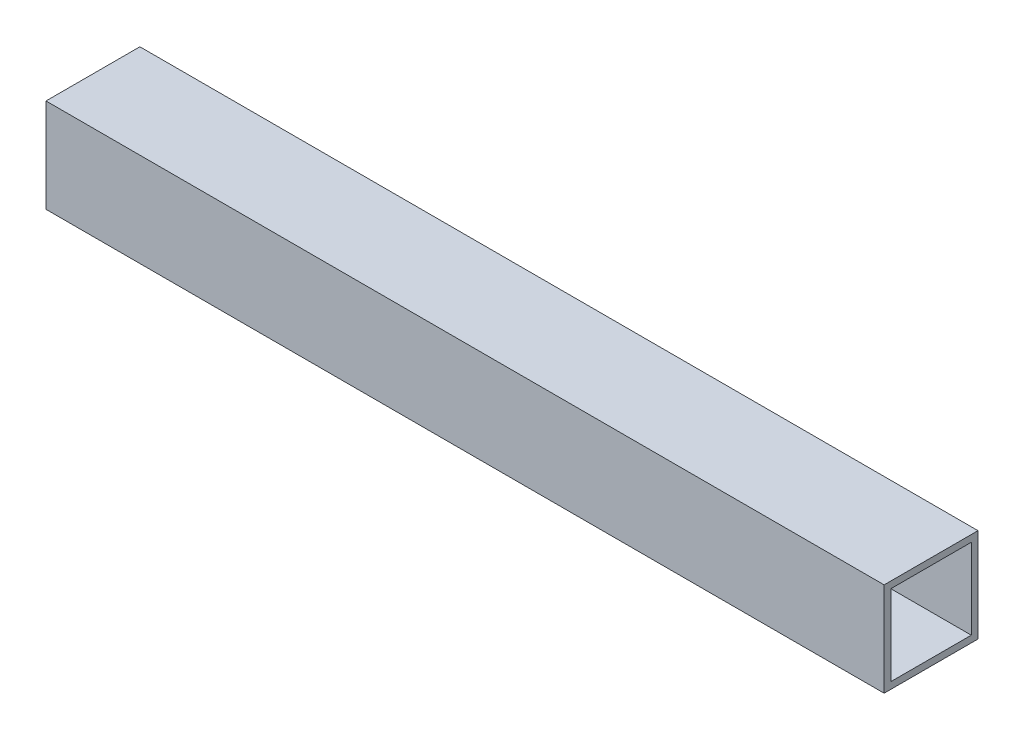
ISO-10303-21;
HEADER;
FILE_DESCRIPTION(('STEP AP214'),'2;1');
FILE_NAME('part.step','',(''),(''),'','','');
FILE_SCHEMA(('AUTOMOTIVE_DESIGN { 1 0 10303 214 1 1 1 1 }'));
ENDSEC;
DATA;
#1=APPLICATION_CONTEXT('core data for automotive mechanical design processes');
#2=APPLICATION_PROTOCOL_DEFINITION('international standard','automotive_design',2000,#1);
#3=PRODUCT_CONTEXT('',#1,'mechanical');
#4=PRODUCT('Part','Part','',(#3));
#5=PRODUCT_RELATED_PRODUCT_CATEGORY('part','',(#4));
#6=PRODUCT_DEFINITION_FORMATION('','',#4);
#7=PRODUCT_DEFINITION_CONTEXT('part definition',#1,'design');
#8=PRODUCT_DEFINITION('design','',#6,#7);
#9=PRODUCT_DEFINITION_SHAPE('','',#8);
#10=(LENGTH_UNIT() NAMED_UNIT(*) SI_UNIT(.MILLI.,.METRE.));
#11=(NAMED_UNIT(*) PLANE_ANGLE_UNIT() SI_UNIT($,.RADIAN.));
#12=(NAMED_UNIT(*) SI_UNIT($,.STERADIAN.) SOLID_ANGLE_UNIT());
#13=UNCERTAINTY_MEASURE_WITH_UNIT(LENGTH_MEASURE(1.E-05),#10,'distance_accuracy_value','');
#14=(GEOMETRIC_REPRESENTATION_CONTEXT(3) GLOBAL_UNCERTAINTY_ASSIGNED_CONTEXT((#13)) GLOBAL_UNIT_ASSIGNED_CONTEXT((#10,
#11,#12)) REPRESENTATION_CONTEXT('',''));
#15=CARTESIAN_POINT('',(0.,0.,0.));
#16=DIRECTION('',(0.,0.,1.));
#17=DIRECTION('',(1.,0.,0.));
#18=AXIS2_PLACEMENT_3D('',#15,#16,#17);
#19=CARTESIAN_POINT('',(461.9625,-793.75,44.45));
#20=DIRECTION('',(0.,-1.,0.));
#21=DIRECTION('',(1.,0.,0.));
#22=AXIS2_PLACEMENT_3D('',#19,#20,#21);
#23=PLANE('',#22);
#24=DIRECTION('',(0.,0.,1.));
#25=VECTOR('',#24,1.);
#26=CARTESIAN_POINT('',(263.525,-793.75,44.45));
#27=LINE('',#26,#25);
#28=CARTESIAN_POINT('',(263.525,-793.75,44.45));
#29=VERTEX_POINT('',#28);
#30=CARTESIAN_POINT('',(263.525,-793.75,0.));
#31=VERTEX_POINT('',#30);
#32=EDGE_CURVE('E168',#29,#31,#27,.F.);
#33=ORIENTED_EDGE('',*,*,#32,.F.);
#34=DIRECTION('',(1.,0.,0.));
#35=VECTOR('',#34,1.);
#36=CARTESIAN_POINT('',(461.9625,-793.75,44.45));
#37=LINE('',#36,#35);
#38=CARTESIAN_POINT('',(660.4,-793.75,44.45));
#39=VERTEX_POINT('',#38);
#40=EDGE_CURVE('E157',#39,#29,#37,.F.);
#41=ORIENTED_EDGE('',*,*,#40,.F.);
#42=DIRECTION('',(0.,0.,1.));
#43=VECTOR('',#42,1.);
#44=CARTESIAN_POINT('',(660.4,-793.75,44.45));
#45=LINE('',#44,#43);
#46=CARTESIAN_POINT('',(660.4,-793.75,0.));
#47=VERTEX_POINT('',#46);
#48=EDGE_CURVE('E135',#39,#47,#45,.F.);
#49=ORIENTED_EDGE('',*,*,#48,.T.);
#50=DIRECTION('',(1.,0.,0.));
#51=VECTOR('',#50,1.);
#52=CARTESIAN_POINT('',(461.9625,-793.75,0.));
#53=LINE('',#52,#51);
#54=EDGE_CURVE('E138',#47,#31,#53,.F.);
#55=ORIENTED_EDGE('',*,*,#54,.T.);
#56=EDGE_LOOP('',(#33,#41,#49,#55));
#57=FACE_BOUND('',#56,.T.);
#58=ADVANCED_FACE('F16',(#57),#23,.F.);
#59=CARTESIAN_POINT('',(461.9625,-835.025,44.45));
#60=DIRECTION('',(0.,-1.,0.));
#61=DIRECTION('',(1.,0.,0.));
#62=AXIS2_PLACEMENT_3D('',#59,#60,#61);
#63=PLANE('',#62);
#64=DIRECTION('',(0.,0.,1.));
#65=VECTOR('',#64,1.);
#66=CARTESIAN_POINT('',(263.525,-835.025,44.45));
#67=LINE('',#66,#65);
#68=CARTESIAN_POINT('',(263.525,-835.025,41.275));
#69=VERTEX_POINT('',#68);
#70=CARTESIAN_POINT('',(263.525,-835.025,3.175));
#71=VERTEX_POINT('',#70);
#72=EDGE_CURVE('E172',#69,#71,#67,.F.);
#73=ORIENTED_EDGE('',*,*,#72,.F.);
#74=DIRECTION('',(1.,0.,0.));
#75=VECTOR('',#74,1.);
#76=CARTESIAN_POINT('',(461.9625,-835.025,41.275));
#77=LINE('',#76,#75);
#78=CARTESIAN_POINT('',(660.4,-835.025,41.275));
#79=VERTEX_POINT('',#78);
#80=EDGE_CURVE('E118',#69,#79,#77,.T.);
#81=ORIENTED_EDGE('',*,*,#80,.T.);
#82=DIRECTION('',(0.,0.,1.));
#83=VECTOR('',#82,1.);
#84=CARTESIAN_POINT('',(660.4,-835.025,44.45));
#85=LINE('',#84,#83);
#86=CARTESIAN_POINT('',(660.4,-835.025,3.175));
#87=VERTEX_POINT('',#86);
#88=EDGE_CURVE('E122',#79,#87,#85,.F.);
#89=ORIENTED_EDGE('',*,*,#88,.T.);
#90=DIRECTION('',(1.,0.,0.));
#91=VECTOR('',#90,1.);
#92=CARTESIAN_POINT('',(461.9625,-835.025,3.175));
#93=LINE('',#92,#91);
#94=EDGE_CURVE('E19',#71,#87,#93,.T.);
#95=ORIENTED_EDGE('',*,*,#94,.F.);
#96=EDGE_LOOP('',(#73,#81,#89,#95));
#97=FACE_BOUND('',#96,.T.);
#98=ADVANCED_FACE('F279',(#97),#63,.F.);
#99=CARTESIAN_POINT('',(461.9625,-815.975,3.175));
#100=DIRECTION('',(0.,0.,1.));
#101=DIRECTION('',(1.,0.,0.));
#102=AXIS2_PLACEMENT_3D('',#99,#100,#101);
#103=PLANE('',#102);
#104=DIRECTION('',(1.,0.,0.));
#105=VECTOR('',#104,1.);
#106=CARTESIAN_POINT('',(461.9625,-796.925,3.175));
#107=LINE('',#106,#105);
#108=CARTESIAN_POINT('',(263.525,-796.925,3.175));
#109=VERTEX_POINT('',#108);
#110=CARTESIAN_POINT('',(660.4,-796.925,3.175));
#111=VERTEX_POINT('',#110);
#112=EDGE_CURVE('E100',#109,#111,#107,.T.);
#113=ORIENTED_EDGE('',*,*,#112,.F.);
#114=DIRECTION('',(0.,1.,0.));
#115=VECTOR('',#114,1.);
#116=CARTESIAN_POINT('',(263.525,-815.975,3.175));
#117=LINE('',#116,#115);
#118=EDGE_CURVE('E150',#71,#109,#117,.T.);
#119=ORIENTED_EDGE('',*,*,#118,.F.);
#120=ORIENTED_EDGE('',*,*,#94,.T.);
#121=DIRECTION('',(0.,1.,0.));
#122=VECTOR('',#121,1.);
#123=CARTESIAN_POINT('',(660.4,-815.975,3.175));
#124=LINE('',#123,#122);
#125=EDGE_CURVE('E129',#87,#111,#124,.T.);
#126=ORIENTED_EDGE('',*,*,#125,.T.);
#127=EDGE_LOOP('',(#113,#119,#120,#126));
#128=FACE_BOUND('',#127,.T.);
#129=ADVANCED_FACE('F148',(#128),#103,.T.);
#130=CARTESIAN_POINT('',(461.9625,-796.925,44.45));
#131=DIRECTION('',(0.,-1.,0.));
#132=DIRECTION('',(1.,0.,0.));
#133=AXIS2_PLACEMENT_3D('',#130,#131,#132);
#134=PLANE('',#133);
#135=DIRECTION('',(1.,0.,0.));
#136=VECTOR('',#135,1.);
#137=CARTESIAN_POINT('',(461.9625,-796.925,41.275));
#138=LINE('',#137,#136);
#139=CARTESIAN_POINT('',(660.4,-796.925,41.275));
#140=VERTEX_POINT('',#139);
#141=CARTESIAN_POINT('',(263.525,-796.925,41.275));
#142=VERTEX_POINT('',#141);
#143=EDGE_CURVE('E98',#140,#142,#138,.F.);
#144=ORIENTED_EDGE('',*,*,#143,.T.);
#145=DIRECTION('',(0.,0.,1.));
#146=VECTOR('',#145,1.);
#147=CARTESIAN_POINT('',(263.525,-796.925,44.45));
#148=LINE('',#147,#146);
#149=EDGE_CURVE('E177',#109,#142,#148,.T.);
#150=ORIENTED_EDGE('',*,*,#149,.F.);
#151=ORIENTED_EDGE('',*,*,#112,.T.);
#152=DIRECTION('',(0.,0.,1.));
#153=VECTOR('',#152,1.);
#154=CARTESIAN_POINT('',(660.4,-796.925,44.45));
#155=LINE('',#154,#153);
#156=EDGE_CURVE('E94',#111,#140,#155,.T.);
#157=ORIENTED_EDGE('',*,*,#156,.T.);
#158=EDGE_LOOP('',(#144,#150,#151,#157));
#159=FACE_BOUND('',#158,.T.);
#160=ADVANCED_FACE('F96',(#159),#134,.T.);
#161=CARTESIAN_POINT('',(461.9625,-815.975,41.275));
#162=DIRECTION('',(0.,0.,1.));
#163=DIRECTION('',(1.,0.,0.));
#164=AXIS2_PLACEMENT_3D('',#161,#162,#163);
#165=PLANE('',#164);
#166=DIRECTION('',(0.,1.,0.));
#167=VECTOR('',#166,1.);
#168=CARTESIAN_POINT('',(263.525,-815.975,41.275));
#169=LINE('',#168,#167);
#170=EDGE_CURVE('E115',#142,#69,#169,.F.);
#171=ORIENTED_EDGE('',*,*,#170,.F.);
#172=ORIENTED_EDGE('',*,*,#143,.F.);
#173=DIRECTION('',(0.,1.,0.));
#174=VECTOR('',#173,1.);
#175=CARTESIAN_POINT('',(660.4,-815.975,41.275));
#176=LINE('',#175,#174);
#177=EDGE_CURVE('E106',#140,#79,#176,.F.);
#178=ORIENTED_EDGE('',*,*,#177,.T.);
#179=ORIENTED_EDGE('',*,*,#80,.F.);
#180=EDGE_LOOP('',(#171,#172,#178,#179));
#181=FACE_BOUND('',#180,.T.);
#182=ADVANCED_FACE('F111',(#181),#165,.F.);
#183=CARTESIAN_POINT('',(461.9625,-815.975,0.));
#184=DIRECTION('',(0.,0.,1.));
#185=DIRECTION('',(1.,0.,0.));
#186=AXIS2_PLACEMENT_3D('',#183,#184,#185);
#187=PLANE('',#186);
#188=DIRECTION('',(0.,1.,0.));
#189=VECTOR('',#188,1.);
#190=CARTESIAN_POINT('',(263.525,-815.975,0.));
#191=LINE('',#190,#189);
#192=CARTESIAN_POINT('',(263.525,-838.2,0.));
#193=VERTEX_POINT('',#192);
#194=EDGE_CURVE('E162',#31,#193,#191,.F.);
#195=ORIENTED_EDGE('',*,*,#194,.F.);
#196=ORIENTED_EDGE('',*,*,#54,.F.);
#197=DIRECTION('',(0.,1.,0.));
#198=VECTOR('',#197,1.);
#199=CARTESIAN_POINT('',(660.4,-815.975,0.));
#200=LINE('',#199,#198);
#201=CARTESIAN_POINT('',(660.4,-838.2,0.));
#202=VERTEX_POINT('',#201);
#203=EDGE_CURVE('E107',#47,#202,#200,.F.);
#204=ORIENTED_EDGE('',*,*,#203,.T.);
#205=DIRECTION('',(1.,0.,0.));
#206=VECTOR('',#205,1.);
#207=CARTESIAN_POINT('',(461.9625,-838.2,0.));
#208=LINE('',#207,#206);
#209=EDGE_CURVE('E182',#193,#202,#208,.T.);
#210=ORIENTED_EDGE('',*,*,#209,.F.);
#211=EDGE_LOOP('',(#195,#196,#204,#210));
#212=FACE_BOUND('',#211,.T.);
#213=ADVANCED_FACE('F203',(#212),#187,.F.);
#214=CARTESIAN_POINT('',(660.4,-815.975,44.45));
#215=DIRECTION('',(-1.,0.,0.));
#216=DIRECTION('',(0.,0.,1.));
#217=AXIS2_PLACEMENT_3D('',#214,#215,#216);
#218=PLANE('',#217);
#219=ORIENTED_EDGE('',*,*,#88,.F.);
#220=ORIENTED_EDGE('',*,*,#177,.F.);
#221=ORIENTED_EDGE('',*,*,#156,.F.);
#222=ORIENTED_EDGE('',*,*,#125,.F.);
#223=EDGE_LOOP('',(#219,#220,#221,#222));
#224=FACE_BOUND('',#223,.T.);
#225=ORIENTED_EDGE('',*,*,#48,.F.);
#226=DIRECTION('',(0.,1.,0.));
#227=VECTOR('',#226,1.);
#228=CARTESIAN_POINT('',(660.4,-815.975,44.45));
#229=LINE('',#228,#227);
#230=CARTESIAN_POINT('',(660.4,-838.2,44.45));
#231=VERTEX_POINT('',#230);
#232=EDGE_CURVE('E154',#231,#39,#229,.T.);
#233=ORIENTED_EDGE('',*,*,#232,.F.);
#234=DIRECTION('',(0.,0.,1.));
#235=VECTOR('',#234,1.);
#236=CARTESIAN_POINT('',(660.4,-838.2,44.45));
#237=LINE('',#236,#235);
#238=EDGE_CURVE('E185',#202,#231,#237,.T.);
#239=ORIENTED_EDGE('',*,*,#238,.F.);
#240=ORIENTED_EDGE('',*,*,#203,.F.);
#241=EDGE_LOOP('',(#225,#233,#239,#240));
#242=FACE_BOUND('',#241,.T.);
#243=ADVANCED_FACE('F120',(#224,#242),#218,.F.);
#244=CARTESIAN_POINT('',(461.9625,-815.975,44.45));
#245=DIRECTION('',(0.,0.,1.));
#246=DIRECTION('',(1.,0.,0.));
#247=AXIS2_PLACEMENT_3D('',#244,#245,#246);
#248=PLANE('',#247);
#249=ORIENTED_EDGE('',*,*,#40,.T.);
#250=DIRECTION('',(0.,1.,0.));
#251=VECTOR('',#250,1.);
#252=CARTESIAN_POINT('',(263.525,-815.975,44.45));
#253=LINE('',#252,#251);
#254=CARTESIAN_POINT('',(263.525,-838.2,44.45));
#255=VERTEX_POINT('',#254);
#256=EDGE_CURVE('E39',#255,#29,#253,.T.);
#257=ORIENTED_EDGE('',*,*,#256,.F.);
#258=DIRECTION('',(1.,0.,0.));
#259=VECTOR('',#258,1.);
#260=CARTESIAN_POINT('',(461.9625,-838.2,44.45));
#261=LINE('',#260,#259);
#262=EDGE_CURVE('E26',#231,#255,#261,.F.);
#263=ORIENTED_EDGE('',*,*,#262,.F.);
#264=ORIENTED_EDGE('',*,*,#232,.T.);
#265=EDGE_LOOP('',(#249,#257,#263,#264));
#266=FACE_BOUND('',#265,.T.);
#267=ADVANCED_FACE('F193',(#266),#248,.T.);
#268=CARTESIAN_POINT('',(263.525,-815.975,44.45));
#269=DIRECTION('',(-1.,0.,0.));
#270=DIRECTION('',(0.,0.,1.));
#271=AXIS2_PLACEMENT_3D('',#268,#269,#270);
#272=PLANE('',#271);
#273=ORIENTED_EDGE('',*,*,#149,.T.);
#274=ORIENTED_EDGE('',*,*,#170,.T.);
#275=ORIENTED_EDGE('',*,*,#72,.T.);
#276=ORIENTED_EDGE('',*,*,#118,.T.);
#277=EDGE_LOOP('',(#273,#274,#275,#276));
#278=FACE_BOUND('',#277,.T.);
#279=ORIENTED_EDGE('',*,*,#256,.T.);
#280=ORIENTED_EDGE('',*,*,#32,.T.);
#281=ORIENTED_EDGE('',*,*,#194,.T.);
#282=DIRECTION('',(0.,0.,1.));
#283=VECTOR('',#282,1.);
#284=CARTESIAN_POINT('',(263.525,-838.2,44.45));
#285=LINE('',#284,#283);
#286=EDGE_CURVE('E11',#255,#193,#285,.F.);
#287=ORIENTED_EDGE('',*,*,#286,.F.);
#288=EDGE_LOOP('',(#279,#280,#281,#287));
#289=FACE_BOUND('',#288,.T.);
#290=ADVANCED_FACE('F201',(#278,#289),#272,.T.);
#291=CARTESIAN_POINT('',(461.9625,-838.2,44.45));
#292=DIRECTION('',(0.,-1.,0.));
#293=DIRECTION('',(1.,0.,0.));
#294=AXIS2_PLACEMENT_3D('',#291,#292,#293);
#295=PLANE('',#294);
#296=ORIENTED_EDGE('',*,*,#262,.T.);
#297=ORIENTED_EDGE('',*,*,#286,.T.);
#298=ORIENTED_EDGE('',*,*,#209,.T.);
#299=ORIENTED_EDGE('',*,*,#238,.T.);
#300=EDGE_LOOP('',(#296,#297,#298,#299));
#301=FACE_BOUND('',#300,.T.);
#302=ADVANCED_FACE('F191',(#301),#295,.T.);
#303=CLOSED_SHELL('',(#58,#98,#129,#160,#182,#213,#243,#267,#290,#302));
#304=MANIFOLD_SOLID_BREP('B1',#303);
#305=ADVANCED_BREP_SHAPE_REPRESENTATION('',(#18,#304),#14);
#306=SHAPE_DEFINITION_REPRESENTATION(#9,#305);
ENDSEC;
END-ISO-10303-21;
